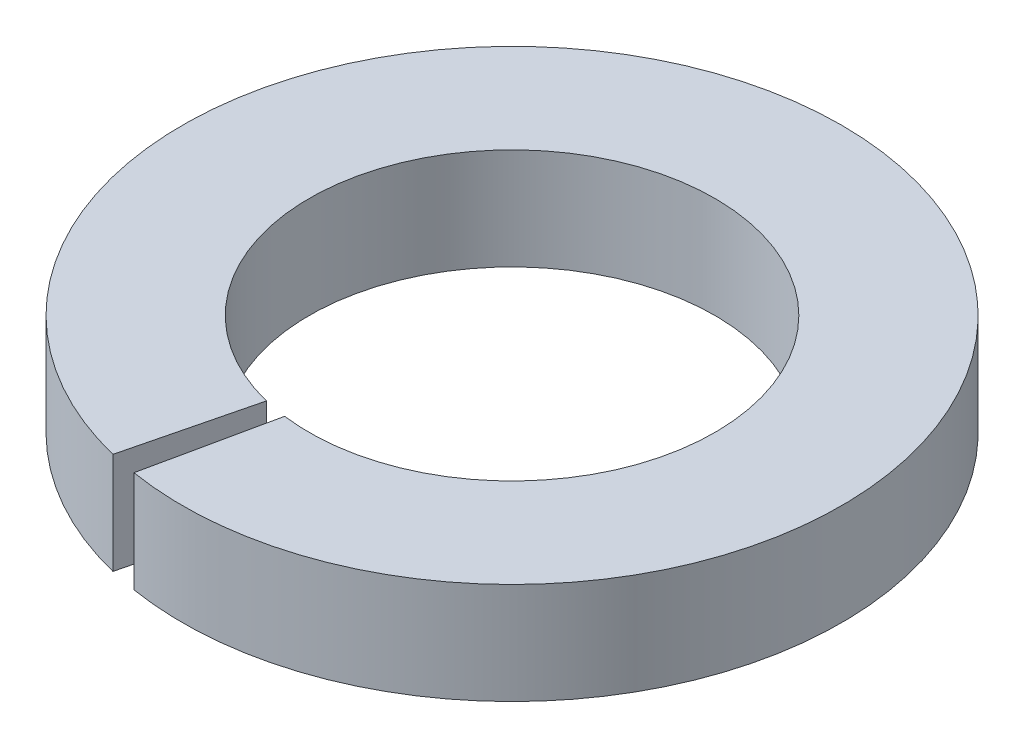
ISO-10303-21;
HEADER;
FILE_DESCRIPTION(('STEP AP214'),'2;1');
FILE_NAME('part.step','',(''),(''),'','','');
FILE_SCHEMA(('AUTOMOTIVE_DESIGN { 1 0 10303 214 1 1 1 1 }'));
ENDSEC;
DATA;
#1=APPLICATION_CONTEXT('core data for automotive mechanical design processes');
#2=APPLICATION_PROTOCOL_DEFINITION('international standard','automotive_design',2000,#1);
#3=PRODUCT_CONTEXT('',#1,'mechanical');
#4=PRODUCT('Part','Part','',(#3));
#5=PRODUCT_RELATED_PRODUCT_CATEGORY('part','',(#4));
#6=PRODUCT_DEFINITION_FORMATION('','',#4);
#7=PRODUCT_DEFINITION_CONTEXT('part definition',#1,'design');
#8=PRODUCT_DEFINITION('design','',#6,#7);
#9=PRODUCT_DEFINITION_SHAPE('','',#8);
#10=(LENGTH_UNIT() NAMED_UNIT(*) SI_UNIT(.MILLI.,.METRE.));
#11=(NAMED_UNIT(*) PLANE_ANGLE_UNIT() SI_UNIT($,.RADIAN.));
#12=(NAMED_UNIT(*) SI_UNIT($,.STERADIAN.) SOLID_ANGLE_UNIT());
#13=UNCERTAINTY_MEASURE_WITH_UNIT(LENGTH_MEASURE(1.E-05),#10,'distance_accuracy_value','');
#14=(GEOMETRIC_REPRESENTATION_CONTEXT(3) GLOBAL_UNCERTAINTY_ASSIGNED_CONTEXT((#13)) GLOBAL_UNIT_ASSIGNED_CONTEXT((#10,
#11,#12)) REPRESENTATION_CONTEXT('',''));
#15=CARTESIAN_POINT('',(0.,0.,0.));
#16=DIRECTION('',(0.,0.,1.));
#17=DIRECTION('',(1.,0.,0.));
#18=AXIS2_PLACEMENT_3D('',#15,#16,#17);
#19=CARTESIAN_POINT('',(7.7715611723761E-13,1.,1.97064586870965E-12));
#20=DIRECTION('',(0.,-1.,0.));
#21=DIRECTION('',(0.,0.,-1.00000000000022));
#22=AXIS2_PLACEMENT_3D('',#19,#20,#21);
#23=CYLINDRICAL_SURFACE('',#22,2.);
#24=CARTESIAN_POINT('',(0.,0.,0.));
#25=DIRECTION('',(0.,-1.,0.));
#26=DIRECTION('',(0.,0.,1.00000000000022));
#27=AXIS2_PLACEMENT_3D('',#24,#25,#26);
#28=CIRCLE('',#27,2.);
#29=CARTESIAN_POINT('',(-0.480978538578675,8.77032821366974E-12,1.94130359434802));
#30=VERTEX_POINT('',#29);
#31=CARTESIAN_POINT('',(-0.25979484123359,8.46545056276682E-12,1.98305487580919));
#32=VERTEX_POINT('',#31);
#33=EDGE_CURVE('E107',#30,#32,#28,.T.);
#34=ORIENTED_EDGE('',*,*,#33,.T.);
#35=DIRECTION('',(0.,-1.,0.));
#36=VECTOR('',#35,1.);
#37=CARTESIAN_POINT('',(-0.259794841232286,1.00000000000847,1.98305487581107));
#38=LINE('',#37,#36);
#39=CARTESIAN_POINT('',(-0.259794841232286,1.00000000000847,1.98305487581107));
#40=VERTEX_POINT('',#39);
#41=EDGE_CURVE('E13',#40,#32,#38,.T.);
#42=ORIENTED_EDGE('',*,*,#41,.F.);
#43=CARTESIAN_POINT('',(7.7715611723761E-13,1.,1.97064586870965E-12));
#44=DIRECTION('',(0.,-1.,0.));
#45=DIRECTION('',(0.,0.,1.00000000000022));
#46=AXIS2_PLACEMENT_3D('',#43,#44,#45);
#47=CIRCLE('',#46,2.);
#48=CARTESIAN_POINT('',(-0.480978538577842,1.00000000000877,1.94130359435055));
#49=VERTEX_POINT('',#48);
#50=EDGE_CURVE('E95',#49,#40,#47,.T.);
#51=ORIENTED_EDGE('',*,*,#50,.F.);
#52=DIRECTION('',(0.,-1.,0.));
#53=VECTOR('',#52,1.);
#54=CARTESIAN_POINT('',(-0.480978538577842,1.00000000000877,1.94130359435055));
#55=LINE('',#54,#53);
#56=EDGE_CURVE('E103',#49,#30,#55,.T.);
#57=ORIENTED_EDGE('',*,*,#56,.T.);
#58=EDGE_LOOP('',(#34,#42,#51,#57));
#59=FACE_BOUND('',#58,.T.);
#60=ADVANCED_FACE('F44',(#59),#23,.F.);
#61=CARTESIAN_POINT('',(-0.521060083461762,1.00000000001238,3.20795828985182));
#62=DIRECTION('',(0.978000572061724,0.,0.208602207675811));
#63=DIRECTION('',(0.208602207675795,0.,-0.978000572061806));
#64=AXIS2_PLACEMENT_3D('',#61,#62,#63);
#65=PLANE('',#64);
#66=DIRECTION('',(-0.208602207675795,0.,0.978000572061806));
#67=VECTOR('',#66,1.);
#68=CARTESIAN_POINT('',(-0.521060083461346,1.22955031572891E-11,3.20795828985201));
#69=LINE('',#68,#67);
#70=CARTESIAN_POINT('',(-0.521060083461346,1.22955031572891E-11,3.20795828985201));
#71=VERTEX_POINT('',#70);
#72=EDGE_CURVE('E99',#32,#71,#69,.T.);
#73=ORIENTED_EDGE('',*,*,#72,.T.);
#74=DIRECTION('',(0.,-1.,0.));
#75=VECTOR('',#74,1.);
#76=CARTESIAN_POINT('',(-0.521060083461762,1.00000000001238,3.20795828985182));
#77=LINE('',#76,#75);
#78=CARTESIAN_POINT('',(-0.521060083461762,1.00000000001238,3.20795828985182));
#79=VERTEX_POINT('',#78);
#80=EDGE_CURVE('E52',#79,#71,#77,.T.);
#81=ORIENTED_EDGE('',*,*,#80,.F.);
#82=DIRECTION('',(-0.208602207675795,0.,0.978000572061806));
#83=VECTOR('',#82,1.);
#84=CARTESIAN_POINT('',(-0.521060083461762,1.00000000001238,3.20795828985182));
#85=LINE('',#84,#83);
#86=EDGE_CURVE('E90',#40,#79,#85,.T.);
#87=ORIENTED_EDGE('',*,*,#86,.F.);
#88=ORIENTED_EDGE('',*,*,#41,.T.);
#89=EDGE_LOOP('',(#73,#81,#87,#88));
#90=FACE_BOUND('',#89,.T.);
#91=ADVANCED_FACE('F98',(#90),#65,.F.);
#92=CARTESIAN_POINT('',(7.7715611723761E-13,1.,1.97064586870965E-12));
#93=DIRECTION('',(0.,-1.,0.));
#94=DIRECTION('',(0.,0.,-1.00000000000022));
#95=AXIS2_PLACEMENT_3D('',#92,#93,#94);
#96=CYLINDRICAL_SURFACE('',#95,3.25);
#97=CARTESIAN_POINT('',(0.,0.,0.));
#98=DIRECTION('',(0.,1.,0.));
#99=DIRECTION('',(0.,0.,1.00000000000022));
#100=AXIS2_PLACEMENT_3D('',#97,#98,#99);
#101=CIRCLE('',#100,3.25);
#102=CARTESIAN_POINT('',(-0.781590125190947,4.24638622875673E-12,3.15461834081749));
#103=VERTEX_POINT('',#102);
#104=EDGE_CURVE('E77',#71,#103,#101,.T.);
#105=ORIENTED_EDGE('',*,*,#104,.T.);
#106=DIRECTION('',(0.,-1.,0.));
#107=VECTOR('',#106,1.);
#108=CARTESIAN_POINT('',(-0.781590125190919,1.00000000000067,3.15461834081632));
#109=LINE('',#108,#107);
#110=CARTESIAN_POINT('',(-0.781590125190919,1.00000000000067,3.15461834081632));
#111=VERTEX_POINT('',#110);
#112=EDGE_CURVE('E100',#111,#103,#109,.T.);
#113=ORIENTED_EDGE('',*,*,#112,.F.);
#114=CARTESIAN_POINT('',(7.7715611723761E-13,1.,1.97064586870965E-12));
#115=DIRECTION('',(0.,1.,0.));
#116=DIRECTION('',(0.,0.,1.00000000000022));
#117=AXIS2_PLACEMENT_3D('',#114,#115,#116);
#118=CIRCLE('',#117,3.25);
#119=EDGE_CURVE('E93',#79,#111,#118,.T.);
#120=ORIENTED_EDGE('',*,*,#119,.F.);
#121=ORIENTED_EDGE('',*,*,#80,.T.);
#122=EDGE_LOOP('',(#105,#113,#120,#121));
#123=FACE_BOUND('',#122,.T.);
#124=ADVANCED_FACE('F101',(#123),#96,.T.);
#125=CARTESIAN_POINT('',(-0.480978538577842,1.00000000000877,1.94130359435055));
#126=DIRECTION('',(-0.970651797173965,0.,-0.240489269289164));
#127=DIRECTION('',(-0.240489269289141,0.,0.970651797174041));
#128=AXIS2_PLACEMENT_3D('',#125,#126,#127);
#129=PLANE('',#128);
#130=DIRECTION('',(0.240489269289142,0.,-0.970651797174043));
#131=VECTOR('',#130,1.);
#132=CARTESIAN_POINT('',(-0.480978538578675,8.77032821366974E-12,1.94130359434802));
#133=LINE('',#132,#131);
#134=EDGE_CURVE('E83',#103,#30,#133,.T.);
#135=ORIENTED_EDGE('',*,*,#134,.T.);
#136=ORIENTED_EDGE('',*,*,#56,.F.);
#137=DIRECTION('',(0.240489269289142,0.,-0.970651797174043));
#138=VECTOR('',#137,1.);
#139=CARTESIAN_POINT('',(-0.480978538577842,1.00000000000877,1.94130359435055));
#140=LINE('',#139,#138);
#141=EDGE_CURVE('E60',#111,#49,#140,.T.);
#142=ORIENTED_EDGE('',*,*,#141,.F.);
#143=ORIENTED_EDGE('',*,*,#112,.T.);
#144=EDGE_LOOP('',(#135,#136,#142,#143));
#145=FACE_BOUND('',#144,.T.);
#146=ADVANCED_FACE('F114',(#145),#129,.F.);
#147=CARTESIAN_POINT('',(7.7715611723761E-13,1.,1.97064586870965E-12));
#148=DIRECTION('',(0.,1.,0.));
#149=DIRECTION('',(0.,0.,1.00000000000022));
#150=AXIS2_PLACEMENT_3D('',#147,#148,#149);
#151=PLANE('',#150);
#152=ORIENTED_EDGE('',*,*,#50,.T.);
#153=ORIENTED_EDGE('',*,*,#86,.T.);
#154=ORIENTED_EDGE('',*,*,#119,.T.);
#155=ORIENTED_EDGE('',*,*,#141,.T.);
#156=EDGE_LOOP('',(#152,#153,#154,#155));
#157=FACE_BOUND('',#156,.T.);
#158=ADVANCED_FACE('F91',(#157),#151,.T.);
#159=CARTESIAN_POINT('',(0.,0.,0.));
#160=DIRECTION('',(0.,1.,0.));
#161=DIRECTION('',(0.,0.,1.00000000000022));
#162=AXIS2_PLACEMENT_3D('',#159,#160,#161);
#163=PLANE('',#162);
#164=ORIENTED_EDGE('',*,*,#33,.F.);
#165=ORIENTED_EDGE('',*,*,#134,.F.);
#166=ORIENTED_EDGE('',*,*,#104,.F.);
#167=ORIENTED_EDGE('',*,*,#72,.F.);
#168=EDGE_LOOP('',(#164,#165,#166,#167));
#169=FACE_BOUND('',#168,.T.);
#170=ADVANCED_FACE('F117',(#169),#163,.F.);
#171=CLOSED_SHELL('',(#60,#91,#124,#146,#158,#170));
#172=MANIFOLD_SOLID_BREP('B2',#171);
#173=ADVANCED_BREP_SHAPE_REPRESENTATION('',(#18,#172),#14);
#174=SHAPE_DEFINITION_REPRESENTATION(#9,#173);
ENDSEC;
END-ISO-10303-21;
